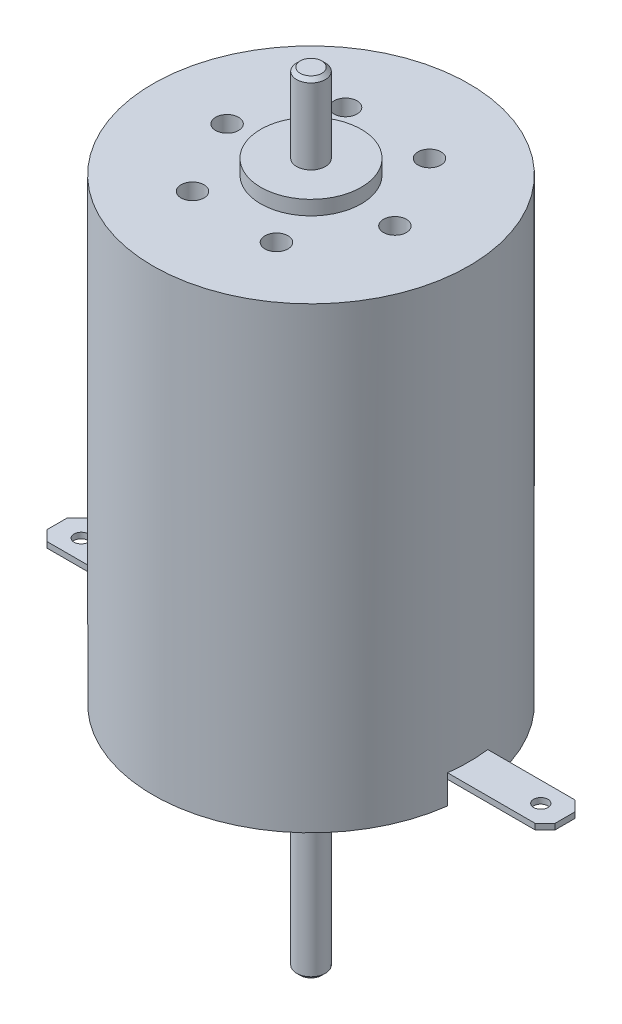
ISO-10303-21;
HEADER;
FILE_DESCRIPTION(('STEP AP214'),'2;1');
FILE_NAME('part.step','',(''),(''),'','','');
FILE_SCHEMA(('AUTOMOTIVE_DESIGN { 1 0 10303 214 1 1 1 1 }'));
ENDSEC;
DATA;
#1=APPLICATION_CONTEXT('core data for automotive mechanical design processes');
#2=APPLICATION_PROTOCOL_DEFINITION('international standard','automotive_design',2000,#1);
#3=PRODUCT_CONTEXT('',#1,'mechanical');
#4=PRODUCT('Part','Part','',(#3));
#5=PRODUCT_RELATED_PRODUCT_CATEGORY('part','',(#4));
#6=PRODUCT_DEFINITION_FORMATION('','',#4);
#7=PRODUCT_DEFINITION_CONTEXT('part definition',#1,'design');
#8=PRODUCT_DEFINITION('design','',#6,#7);
#9=PRODUCT_DEFINITION_SHAPE('','',#8);
#10=(LENGTH_UNIT() NAMED_UNIT(*) SI_UNIT(.MILLI.,.METRE.));
#11=(NAMED_UNIT(*) PLANE_ANGLE_UNIT() SI_UNIT($,.RADIAN.));
#12=(NAMED_UNIT(*) SI_UNIT($,.STERADIAN.) SOLID_ANGLE_UNIT());
#13=UNCERTAINTY_MEASURE_WITH_UNIT(LENGTH_MEASURE(1.E-05),#10,'distance_accuracy_value','');
#14=(GEOMETRIC_REPRESENTATION_CONTEXT(3) GLOBAL_UNCERTAINTY_ASSIGNED_CONTEXT((#13)) GLOBAL_UNIT_ASSIGNED_CONTEXT((#10,
#11,#12)) REPRESENTATION_CONTEXT('',''));
#15=CARTESIAN_POINT('',(0.,0.,0.));
#16=DIRECTION('',(0.,0.,1.));
#17=DIRECTION('',(1.,0.,0.));
#18=AXIS2_PLACEMENT_3D('',#15,#16,#17);
#19=CARTESIAN_POINT('',(-11.9169719169719,2.,1.4));
#20=DIRECTION('',(0.,0.,1.));
#21=DIRECTION('',(1.,0.,0.));
#22=AXIS2_PLACEMENT_3D('',#19,#20,#21);
#23=PLANE('',#22);
#24=DIRECTION('',(1.,0.,0.));
#25=VECTOR('',#24,1.);
#26=CARTESIAN_POINT('',(-17.7,1.6,1.4));
#27=LINE('',#26,#25);
#28=CARTESIAN_POINT('',(-10.9105453575887,1.6,1.4));
#29=VERTEX_POINT('',#28);
#30=CARTESIAN_POINT('',(-8.5,1.6,1.4));
#31=VERTEX_POINT('',#30);
#32=EDGE_CURVE('E191',#29,#31,#27,.T.);
#33=ORIENTED_EDGE('',*,*,#32,.T.);
#34=DIRECTION('',(0.,-1.,0.));
#35=VECTOR('',#34,1.);
#36=CARTESIAN_POINT('',(-8.5,2.,1.4));
#37=LINE('',#36,#35);
#38=CARTESIAN_POINT('',(-8.5,0.,1.4));
#39=VERTEX_POINT('',#38);
#40=EDGE_CURVE('E175',#31,#39,#37,.T.);
#41=ORIENTED_EDGE('',*,*,#40,.T.);
#42=DIRECTION('',(-1.,0.,0.));
#43=VECTOR('',#42,1.);
#44=CARTESIAN_POINT('',(-11.9169719169719,0.,1.4));
#45=LINE('',#44,#43);
#46=CARTESIAN_POINT('',(-10.9105453575887,0.,1.4));
#47=VERTEX_POINT('',#46);
#48=EDGE_CURVE('E262',#39,#47,#45,.T.);
#49=ORIENTED_EDGE('',*,*,#48,.T.);
#50=DIRECTION('',(0.,-1.,0.));
#51=VECTOR('',#50,1.);
#52=CARTESIAN_POINT('',(-10.9105453575887,31.9,1.4));
#53=LINE('',#52,#51);
#54=EDGE_CURVE('E192',#29,#47,#53,.T.);
#55=ORIENTED_EDGE('',*,*,#54,.F.);
#56=EDGE_LOOP('',(#33,#41,#49,#55));
#57=FACE_BOUND('',#56,.T.);
#58=ADVANCED_FACE('F33',(#57),#23,.F.);
#59=CARTESIAN_POINT('',(-11.9169719169719,2.,-1.4));
#60=DIRECTION('',(0.,0.,-1.));
#61=DIRECTION('',(-1.,0.,0.));
#62=AXIS2_PLACEMENT_3D('',#59,#60,#61);
#63=PLANE('',#62);
#64=DIRECTION('',(1.,0.,0.));
#65=VECTOR('',#64,1.);
#66=CARTESIAN_POINT('',(-17.7,1.6,-1.4));
#67=LINE('',#66,#65);
#68=CARTESIAN_POINT('',(-10.9105453575887,1.6,-1.4));
#69=VERTEX_POINT('',#68);
#70=CARTESIAN_POINT('',(-8.5,1.6,-1.4));
#71=VERTEX_POINT('',#70);
#72=EDGE_CURVE('E203',#69,#71,#67,.T.);
#73=ORIENTED_EDGE('',*,*,#72,.F.);
#74=DIRECTION('',(0.,-1.,0.));
#75=VECTOR('',#74,1.);
#76=CARTESIAN_POINT('',(-10.9105453575887,31.9,-1.4));
#77=LINE('',#76,#75);
#78=CARTESIAN_POINT('',(-10.9105453575887,0.,-1.4));
#79=VERTEX_POINT('',#78);
#80=EDGE_CURVE('E340',#79,#69,#77,.F.);
#81=ORIENTED_EDGE('',*,*,#80,.F.);
#82=DIRECTION('',(1.,0.,0.));
#83=VECTOR('',#82,1.);
#84=CARTESIAN_POINT('',(-11.9169719169719,0.,-1.4));
#85=LINE('',#84,#83);
#86=CARTESIAN_POINT('',(-8.5,0.,-1.4));
#87=VERTEX_POINT('',#86);
#88=EDGE_CURVE('E257',#79,#87,#85,.T.);
#89=ORIENTED_EDGE('',*,*,#88,.T.);
#90=DIRECTION('',(0.,-1.,0.));
#91=VECTOR('',#90,1.);
#92=CARTESIAN_POINT('',(-8.5,2.,-1.4));
#93=LINE('',#92,#91);
#94=EDGE_CURVE('E187',#71,#87,#93,.T.);
#95=ORIENTED_EDGE('',*,*,#94,.F.);
#96=EDGE_LOOP('',(#73,#81,#89,#95));
#97=FACE_BOUND('',#96,.T.);
#98=ADVANCED_FACE('F417',(#97),#63,.F.);
#99=CARTESIAN_POINT('',(-8.5,2.,1.4));
#100=DIRECTION('',(1.,0.,0.));
#101=DIRECTION('',(0.,0.,-1.));
#102=AXIS2_PLACEMENT_3D('',#99,#100,#101);
#103=PLANE('',#102);
#104=DIRECTION('',(0.,0.,1.));
#105=VECTOR('',#104,1.);
#106=CARTESIAN_POINT('',(-8.5,1.6,-1.4));
#107=LINE('',#106,#105);
#108=EDGE_CURVE('E179',#71,#31,#107,.T.);
#109=ORIENTED_EDGE('',*,*,#108,.F.);
#110=ORIENTED_EDGE('',*,*,#94,.T.);
#111=DIRECTION('',(0.,0.,1.));
#112=VECTOR('',#111,1.);
#113=CARTESIAN_POINT('',(-8.5,0.,1.4));
#114=LINE('',#113,#112);
#115=EDGE_CURVE('E182',#87,#39,#114,.T.);
#116=ORIENTED_EDGE('',*,*,#115,.T.);
#117=ORIENTED_EDGE('',*,*,#40,.F.);
#118=EDGE_LOOP('',(#109,#110,#116,#117));
#119=FACE_BOUND('',#118,.T.);
#120=ADVANCED_FACE('F177',(#119),#103,.F.);
#121=CARTESIAN_POINT('',(11.9169719169719,2.,-1.39999999999992));
#122=DIRECTION('',(0.,0.,-1.));
#123=DIRECTION('',(-1.,0.,0.));
#124=AXIS2_PLACEMENT_3D('',#121,#122,#123);
#125=PLANE('',#124);
#126=DIRECTION('',(-1.,0.,0.));
#127=VECTOR('',#126,1.);
#128=CARTESIAN_POINT('',(17.7,1.6,-1.39999999999987));
#129=LINE('',#128,#127);
#130=CARTESIAN_POINT('',(10.9105453575887,1.6,-1.39999999999992));
#131=VERTEX_POINT('',#130);
#132=CARTESIAN_POINT('',(8.50000000000001,1.6,-1.39999999999994));
#133=VERTEX_POINT('',#132);
#134=EDGE_CURVE('E236',#131,#133,#129,.T.);
#135=ORIENTED_EDGE('',*,*,#134,.T.);
#136=DIRECTION('',(0.,-1.,0.));
#137=VECTOR('',#136,1.);
#138=CARTESIAN_POINT('',(8.50000000000001,2.,-1.39999999999994));
#139=LINE('',#138,#137);
#140=CARTESIAN_POINT('',(8.50000000000001,0.,-1.39999999999994));
#141=VERTEX_POINT('',#140);
#142=EDGE_CURVE('E255',#133,#141,#139,.T.);
#143=ORIENTED_EDGE('',*,*,#142,.T.);
#144=DIRECTION('',(1.,0.,0.));
#145=VECTOR('',#144,1.);
#146=CARTESIAN_POINT('',(11.9169719169719,0.,-1.39999999999992));
#147=LINE('',#146,#145);
#148=CARTESIAN_POINT('',(10.9105453575887,0.,-1.39999999999992));
#149=VERTEX_POINT('',#148);
#150=EDGE_CURVE('E251',#141,#149,#147,.T.);
#151=ORIENTED_EDGE('',*,*,#150,.T.);
#152=DIRECTION('',(0.,-1.,0.));
#153=VECTOR('',#152,1.);
#154=CARTESIAN_POINT('',(10.9105453575887,31.9,-1.39999999999992));
#155=LINE('',#154,#153);
#156=EDGE_CURVE('E351',#131,#149,#155,.T.);
#157=ORIENTED_EDGE('',*,*,#156,.F.);
#158=EDGE_LOOP('',(#135,#143,#151,#157));
#159=FACE_BOUND('',#158,.T.);
#160=ADVANCED_FACE('F429',(#159),#125,.F.);
#161=CARTESIAN_POINT('',(11.9169719169719,2.,1.40000000000008));
#162=DIRECTION('',(0.,0.,1.));
#163=DIRECTION('',(1.,0.,0.));
#164=AXIS2_PLACEMENT_3D('',#161,#162,#163);
#165=PLANE('',#164);
#166=DIRECTION('',(-1.,0.,0.));
#167=VECTOR('',#166,1.);
#168=CARTESIAN_POINT('',(17.7,1.6,1.40000000000013));
#169=LINE('',#168,#167);
#170=CARTESIAN_POINT('',(10.9105453575887,1.6,1.40000000000008));
#171=VERTEX_POINT('',#170);
#172=CARTESIAN_POINT('',(8.49999999999999,1.6,1.40000000000006));
#173=VERTEX_POINT('',#172);
#174=EDGE_CURVE('E239',#171,#173,#169,.T.);
#175=ORIENTED_EDGE('',*,*,#174,.F.);
#176=DIRECTION('',(0.,-1.,0.));
#177=VECTOR('',#176,1.);
#178=CARTESIAN_POINT('',(10.9105453575887,31.9,1.40000000000008));
#179=LINE('',#178,#177);
#180=CARTESIAN_POINT('',(10.9105453575887,0.,1.40000000000008));
#181=VERTEX_POINT('',#180);
#182=EDGE_CURVE('E348',#181,#171,#179,.F.);
#183=ORIENTED_EDGE('',*,*,#182,.F.);
#184=DIRECTION('',(-1.,0.,0.));
#185=VECTOR('',#184,1.);
#186=CARTESIAN_POINT('',(11.9169719169719,0.,1.40000000000008));
#187=LINE('',#186,#185);
#188=CARTESIAN_POINT('',(8.49999999999999,0.,1.40000000000006));
#189=VERTEX_POINT('',#188);
#190=EDGE_CURVE('E245',#181,#189,#187,.T.);
#191=ORIENTED_EDGE('',*,*,#190,.T.);
#192=DIRECTION('',(0.,-1.,0.));
#193=VECTOR('',#192,1.);
#194=CARTESIAN_POINT('',(8.49999999999999,2.,1.40000000000006));
#195=LINE('',#194,#193);
#196=EDGE_CURVE('E254',#173,#189,#195,.T.);
#197=ORIENTED_EDGE('',*,*,#196,.F.);
#198=EDGE_LOOP('',(#175,#183,#191,#197));
#199=FACE_BOUND('',#198,.T.);
#200=ADVANCED_FACE('F426',(#199),#165,.F.);
#201=CARTESIAN_POINT('',(8.50000000000001,2.,-1.39999999999994));
#202=DIRECTION('',(-1.,0.,0.));
#203=DIRECTION('',(0.,0.,1.));
#204=AXIS2_PLACEMENT_3D('',#201,#202,#203);
#205=PLANE('',#204);
#206=DIRECTION('',(0.,0.,-1.));
#207=VECTOR('',#206,1.);
#208=CARTESIAN_POINT('',(8.49999999999999,1.6,1.40000000000006));
#209=LINE('',#208,#207);
#210=EDGE_CURVE('E223',#173,#133,#209,.T.);
#211=ORIENTED_EDGE('',*,*,#210,.F.);
#212=ORIENTED_EDGE('',*,*,#196,.T.);
#213=DIRECTION('',(0.,0.,-1.));
#214=VECTOR('',#213,1.);
#215=CARTESIAN_POINT('',(8.50000000000001,0.,-1.39999999999994));
#216=LINE('',#215,#214);
#217=EDGE_CURVE('E248',#189,#141,#216,.T.);
#218=ORIENTED_EDGE('',*,*,#217,.T.);
#219=ORIENTED_EDGE('',*,*,#142,.F.);
#220=EDGE_LOOP('',(#211,#212,#218,#219));
#221=FACE_BOUND('',#220,.T.);
#222=ADVANCED_FACE('F493',(#221),#205,.F.);
#223=CARTESIAN_POINT('',(0.,-2.5,0.));
#224=DIRECTION('',(0.,-1.,0.));
#225=DIRECTION('',(0.,0.,-1.));
#226=AXIS2_PLACEMENT_3D('',#223,#224,#225);
#227=PLANE('',#226);
#228=CARTESIAN_POINT('',(0.,-2.5,0.));
#229=DIRECTION('',(0.,-1.,0.));
#230=DIRECTION('',(0.,0.,-1.));
#231=AXIS2_PLACEMENT_3D('',#228,#229,#230);
#232=CIRCLE('',#231,4.);
#233=CARTESIAN_POINT('',(0.,-2.5,-4.));
#234=VERTEX_POINT('',#233);
#235=EDGE_CURVE('E303',#234,#234,#232,.T.);
#236=ORIENTED_EDGE('',*,*,#235,.T.);
#237=EDGE_LOOP('',(#236));
#238=FACE_BOUND('',#237,.T.);
#239=CARTESIAN_POINT('',(0.,-2.5,0.));
#240=DIRECTION('',(0.,-1.,0.));
#241=DIRECTION('',(0.,0.,-1.));
#242=AXIS2_PLACEMENT_3D('',#239,#240,#241);
#243=CIRCLE('',#242,1.);
#244=CARTESIAN_POINT('',(0.,-2.5,-1.));
#245=VERTEX_POINT('',#244);
#246=EDGE_CURVE('E300',#245,#245,#243,.T.);
#247=ORIENTED_EDGE('',*,*,#246,.F.);
#248=EDGE_LOOP('',(#247));
#249=FACE_BOUND('',#248,.T.);
#250=ADVANCED_FACE('F489',(#238,#249),#227,.T.);
#251=CARTESIAN_POINT('',(0.,0.,0.));
#252=DIRECTION('',(0.,1.,0.));
#253=DIRECTION('',(0.,0.,1.));
#254=AXIS2_PLACEMENT_3D('',#251,#252,#253);
#255=PLANE('',#254);
#256=CARTESIAN_POINT('',(0.,0.,0.));
#257=DIRECTION('',(0.,1.,0.));
#258=DIRECTION('',(0.,0.,1.));
#259=AXIS2_PLACEMENT_3D('',#256,#257,#258);
#260=CIRCLE('',#259,11.);
#261=EDGE_CURVE('E313',#149,#79,#260,.T.);
#262=ORIENTED_EDGE('',*,*,#261,.F.);
#263=ORIENTED_EDGE('',*,*,#150,.F.);
#264=ORIENTED_EDGE('',*,*,#217,.F.);
#265=ORIENTED_EDGE('',*,*,#190,.F.);
#266=EDGE_CURVE('E320',#47,#181,#260,.T.);
#267=ORIENTED_EDGE('',*,*,#266,.F.);
#268=ORIENTED_EDGE('',*,*,#48,.F.);
#269=ORIENTED_EDGE('',*,*,#115,.F.);
#270=ORIENTED_EDGE('',*,*,#88,.F.);
#271=EDGE_LOOP('',(#262,#263,#264,#265,#267,#268,#269,#270));
#272=FACE_BOUND('',#271,.T.);
#273=CARTESIAN_POINT('',(0.,0.,0.));
#274=DIRECTION('',(0.,1.,0.));
#275=DIRECTION('',(0.,0.,1.));
#276=AXIS2_PLACEMENT_3D('',#273,#274,#275);
#277=CIRCLE('',#276,4.);
#278=CARTESIAN_POINT('',(0.,0.,4.));
#279=VERTEX_POINT('',#278);
#280=EDGE_CURVE('E328',#279,#279,#277,.F.);
#281=ORIENTED_EDGE('',*,*,#280,.F.);
#282=EDGE_LOOP('',(#281));
#283=FACE_BOUND('',#282,.T.);
#284=ADVANCED_FACE('F492',(#272,#283),#255,.F.);
#285=CARTESIAN_POINT('',(0.,32.9,0.));
#286=DIRECTION('',(0.,1.,0.));
#287=DIRECTION('',(0.,0.,1.));
#288=AXIS2_PLACEMENT_3D('',#285,#286,#287);
#289=PLANE('',#288);
#290=CARTESIAN_POINT('',(0.,32.9,0.));
#291=DIRECTION('',(0.,1.,0.));
#292=DIRECTION('',(0.,0.,1.));
#293=AXIS2_PLACEMENT_3D('',#290,#291,#292);
#294=CIRCLE('',#293,3.5);
#295=CARTESIAN_POINT('',(0.,32.9,3.5));
#296=VERTEX_POINT('',#295);
#297=EDGE_CURVE('E310',#296,#296,#294,.T.);
#298=ORIENTED_EDGE('',*,*,#297,.T.);
#299=EDGE_LOOP('',(#298));
#300=FACE_BOUND('',#299,.T.);
#301=CARTESIAN_POINT('',(0.,32.9,0.));
#302=DIRECTION('',(0.,1.,0.));
#303=DIRECTION('',(0.,0.,1.));
#304=AXIS2_PLACEMENT_3D('',#301,#302,#303);
#305=CIRCLE('',#304,1.);
#306=CARTESIAN_POINT('',(0.,32.9,1.));
#307=VERTEX_POINT('',#306);
#308=EDGE_CURVE('E306',#307,#307,#305,.T.);
#309=ORIENTED_EDGE('',*,*,#308,.F.);
#310=EDGE_LOOP('',(#309));
#311=FACE_BOUND('',#310,.T.);
#312=ADVANCED_FACE('F508',(#300,#311),#289,.T.);
#313=CARTESIAN_POINT('',(0.,31.9,0.));
#314=DIRECTION('',(0.,1.,0.));
#315=DIRECTION('',(0.,0.,1.));
#316=AXIS2_PLACEMENT_3D('',#313,#314,#315);
#317=PLANE('',#316);
#318=CARTESIAN_POINT('',(-5.99801144222011,31.9,-0.15446274306963));
#319=DIRECTION('',(0.,1.,0.));
#320=DIRECTION('',(0.,0.,1.));
#321=AXIS2_PLACEMENT_3D('',#318,#319,#320);
#322=CIRCLE('',#321,0.79999999999999);
#323=CARTESIAN_POINT('',(-5.99801144222011,31.9,0.64553725693036));
#324=VERTEX_POINT('',#323);
#325=EDGE_CURVE('E267',#324,#324,#322,.T.);
#326=ORIENTED_EDGE('',*,*,#325,.F.);
#327=EDGE_LOOP('',(#326));
#328=FACE_BOUND('',#327,.T.);
#329=CARTESIAN_POINT('',(-3.13277438054657,31.9,5.11719890961755));
#330=DIRECTION('',(0.,1.,0.));
#331=DIRECTION('',(0.,0.,1.));
#332=AXIS2_PLACEMENT_3D('',#329,#330,#331);
#333=CIRCLE('',#332,0.79999999999999);
#334=CARTESIAN_POINT('',(-3.13277438054657,31.9,5.91719890961754));
#335=VERTEX_POINT('',#334);
#336=EDGE_CURVE('E273',#335,#335,#333,.T.);
#337=ORIENTED_EDGE('',*,*,#336,.F.);
#338=EDGE_LOOP('',(#337));
#339=FACE_BOUND('',#338,.T.);
#340=CARTESIAN_POINT('',(2.86523706167355,31.9,5.27166165268716));
#341=DIRECTION('',(0.,1.,0.));
#342=DIRECTION('',(0.,0.,1.));
#343=AXIS2_PLACEMENT_3D('',#340,#341,#342);
#344=CIRCLE('',#343,0.79999999999999);
#345=CARTESIAN_POINT('',(2.86523706167355,31.9,6.07166165268715));
#346=VERTEX_POINT('',#345);
#347=EDGE_CURVE('E279',#346,#346,#344,.T.);
#348=ORIENTED_EDGE('',*,*,#347,.F.);
#349=EDGE_LOOP('',(#348));
#350=FACE_BOUND('',#349,.T.);
#351=CARTESIAN_POINT('',(5.99801144222012,31.9,0.154462743069588));
#352=DIRECTION('',(0.,1.,0.));
#353=DIRECTION('',(0.,0.,1.));
#354=AXIS2_PLACEMENT_3D('',#351,#352,#353);
#355=CIRCLE('',#354,0.79999999999999);
#356=CARTESIAN_POINT('',(5.99801144222012,31.9,0.954462743069578));
#357=VERTEX_POINT('',#356);
#358=EDGE_CURVE('E285',#357,#357,#355,.T.);
#359=ORIENTED_EDGE('',*,*,#358,.F.);
#360=EDGE_LOOP('',(#359));
#361=FACE_BOUND('',#360,.T.);
#362=CARTESIAN_POINT('',(3.13277438054654,31.9,-5.11719890961757));
#363=DIRECTION('',(0.,1.,0.));
#364=DIRECTION('',(0.,0.,1.));
#365=AXIS2_PLACEMENT_3D('',#362,#363,#364);
#366=CIRCLE('',#365,0.79999999999999);
#367=CARTESIAN_POINT('',(3.13277438054654,31.9,-4.31719890961758));
#368=VERTEX_POINT('',#367);
#369=EDGE_CURVE('E291',#368,#368,#366,.T.);
#370=ORIENTED_EDGE('',*,*,#369,.F.);
#371=EDGE_LOOP('',(#370));
#372=FACE_BOUND('',#371,.T.);
#373=CARTESIAN_POINT('',(-2.86523706167359,31.9,-5.27166165268714));
#374=DIRECTION('',(0.,1.,0.));
#375=DIRECTION('',(0.,0.,1.));
#376=AXIS2_PLACEMENT_3D('',#373,#374,#375);
#377=CIRCLE('',#376,0.79999999999999);
#378=CARTESIAN_POINT('',(-2.86523706167359,31.9,-4.47166165268715));
#379=VERTEX_POINT('',#378);
#380=EDGE_CURVE('E297',#379,#379,#377,.T.);
#381=ORIENTED_EDGE('',*,*,#380,.F.);
#382=EDGE_LOOP('',(#381));
#383=FACE_BOUND('',#382,.T.);
#384=CARTESIAN_POINT('',(0.,31.9,0.));
#385=DIRECTION('',(0.,1.,0.));
#386=DIRECTION('',(0.,0.,1.));
#387=AXIS2_PLACEMENT_3D('',#384,#385,#386);
#388=CIRCLE('',#387,11.);
#389=CARTESIAN_POINT('',(0.,31.9,11.));
#390=VERTEX_POINT('',#389);
#391=EDGE_CURVE('E316',#390,#390,#388,.T.);
#392=ORIENTED_EDGE('',*,*,#391,.T.);
#393=EDGE_LOOP('',(#392));
#394=FACE_BOUND('',#393,.T.);
#395=CARTESIAN_POINT('',(0.,31.9,0.));
#396=DIRECTION('',(0.,1.,0.));
#397=DIRECTION('',(0.,0.,1.));
#398=AXIS2_PLACEMENT_3D('',#395,#396,#397);
#399=CIRCLE('',#398,3.5);
#400=CARTESIAN_POINT('',(0.,31.9,3.5));
#401=VERTEX_POINT('',#400);
#402=EDGE_CURVE('E309',#401,#401,#399,.T.);
#403=ORIENTED_EDGE('',*,*,#402,.F.);
#404=EDGE_LOOP('',(#403));
#405=FACE_BOUND('',#404,.T.);
#406=ADVANCED_FACE('F511',(#328,#339,#350,#361,#372,#383,#394,#405),#317,.T.);
#407=CARTESIAN_POINT('',(0.,31.9,0.));
#408=DIRECTION('',(0.,-1.,0.));
#409=DIRECTION('',(0.,0.,-1.));
#410=AXIS2_PLACEMENT_3D('',#407,#408,#409);
#411=CYLINDRICAL_SURFACE('',#410,11.);
#412=ORIENTED_EDGE('',*,*,#391,.F.);
#413=EDGE_LOOP('',(#412));
#414=FACE_BOUND('',#413,.T.);
#415=CARTESIAN_POINT('',(0.,2.,0.));
#416=DIRECTION('',(0.,-1.,0.));
#417=DIRECTION('',(0.,0.,-1.));
#418=AXIS2_PLACEMENT_3D('',#415,#416,#417);
#419=CIRCLE('',#418,11.);
#420=CARTESIAN_POINT('',(10.9105453575887,2.,-1.39999999999992));
#421=VERTEX_POINT('',#420);
#422=CARTESIAN_POINT('',(10.9105453575887,2.,1.40000000000008));
#423=VERTEX_POINT('',#422);
#424=EDGE_CURVE('E345',#421,#423,#419,.T.);
#425=ORIENTED_EDGE('',*,*,#424,.F.);
#426=EDGE_CURVE('E352',#421,#131,#155,.T.);
#427=ORIENTED_EDGE('',*,*,#426,.T.);
#428=ORIENTED_EDGE('',*,*,#156,.T.);
#429=ORIENTED_EDGE('',*,*,#261,.T.);
#430=ORIENTED_EDGE('',*,*,#80,.T.);
#431=DIRECTION('',(0.,-1.,0.));
#432=VECTOR('',#431,1.);
#433=CARTESIAN_POINT('',(-10.9105453575887,31.9,-1.4));
#434=LINE('',#433,#432);
#435=CARTESIAN_POINT('',(-10.9105453575887,2.,-1.4));
#436=VERTEX_POINT('',#435);
#437=EDGE_CURVE('E220',#436,#69,#434,.T.);
#438=ORIENTED_EDGE('',*,*,#437,.F.);
#439=CARTESIAN_POINT('',(0.,2.,0.));
#440=DIRECTION('',(0.,-1.,0.));
#441=DIRECTION('',(0.,0.,-1.));
#442=AXIS2_PLACEMENT_3D('',#439,#440,#441);
#443=CIRCLE('',#442,11.);
#444=CARTESIAN_POINT('',(-10.9105453575887,2.,1.4));
#445=VERTEX_POINT('',#444);
#446=EDGE_CURVE('E337',#445,#436,#443,.T.);
#447=ORIENTED_EDGE('',*,*,#446,.F.);
#448=EDGE_CURVE('E343',#445,#29,#53,.T.);
#449=ORIENTED_EDGE('',*,*,#448,.T.);
#450=ORIENTED_EDGE('',*,*,#54,.T.);
#451=ORIENTED_EDGE('',*,*,#266,.T.);
#452=ORIENTED_EDGE('',*,*,#182,.T.);
#453=DIRECTION('',(0.,-1.,0.));
#454=VECTOR('',#453,1.);
#455=CARTESIAN_POINT('',(10.9105453575887,31.9,1.40000000000008));
#456=LINE('',#455,#454);
#457=EDGE_CURVE('E242',#423,#171,#456,.T.);
#458=ORIENTED_EDGE('',*,*,#457,.F.);
#459=EDGE_LOOP('',(#425,#427,#428,#429,#430,#438,#447,#449,#450,#451,#452,#458));
#460=FACE_BOUND('',#459,.T.);
#461=ADVANCED_FACE('F398',(#414,#460),#411,.T.);
#462=CARTESIAN_POINT('',(0.,32.9,0.));
#463=DIRECTION('',(0.,-1.,0.));
#464=DIRECTION('',(0.,0.,-1.));
#465=AXIS2_PLACEMENT_3D('',#462,#463,#464);
#466=CYLINDRICAL_SURFACE('',#465,3.5);
#467=ORIENTED_EDGE('',*,*,#297,.F.);
#468=EDGE_LOOP('',(#467));
#469=FACE_BOUND('',#468,.T.);
#470=ORIENTED_EDGE('',*,*,#402,.T.);
#471=EDGE_LOOP('',(#470));
#472=FACE_BOUND('',#471,.T.);
#473=ADVANCED_FACE('F506',(#469,#472),#466,.T.);
#474=CARTESIAN_POINT('',(0.,38.4,0.));
#475=DIRECTION('',(0.,-1.,0.));
#476=DIRECTION('',(0.,0.,-1.));
#477=AXIS2_PLACEMENT_3D('',#474,#475,#476);
#478=CYLINDRICAL_SURFACE('',#477,1.);
#479=CARTESIAN_POINT('',(0.,38.15,0.));
#480=DIRECTION('',(0.,1.,0.));
#481=DIRECTION('',(0.,0.,1.));
#482=AXIS2_PLACEMENT_3D('',#479,#480,#481);
#483=CIRCLE('',#482,1.);
#484=CARTESIAN_POINT('',(0.,38.15,1.));
#485=VERTEX_POINT('',#484);
#486=EDGE_CURVE('E325',#485,#485,#483,.F.);
#487=ORIENTED_EDGE('',*,*,#486,.T.);
#488=EDGE_LOOP('',(#487));
#489=FACE_BOUND('',#488,.T.);
#490=ORIENTED_EDGE('',*,*,#308,.T.);
#491=EDGE_LOOP('',(#490));
#492=FACE_BOUND('',#491,.T.);
#493=ADVANCED_FACE('F502',(#489,#492),#478,.T.);
#494=CARTESIAN_POINT('',(0.,38.4,0.));
#495=DIRECTION('',(0.,1.,0.));
#496=DIRECTION('',(0.,0.,1.));
#497=AXIS2_PLACEMENT_3D('',#494,#495,#496);
#498=PLANE('',#497);
#499=CARTESIAN_POINT('',(0.,38.4,0.));
#500=DIRECTION('',(0.,1.,0.));
#501=DIRECTION('',(0.,0.,1.));
#502=AXIS2_PLACEMENT_3D('',#499,#500,#501);
#503=CIRCLE('',#502,0.750000000000001);
#504=CARTESIAN_POINT('',(0.,38.4,0.750000000000001));
#505=VERTEX_POINT('',#504);
#506=EDGE_CURVE('E319',#505,#505,#503,.T.);
#507=ORIENTED_EDGE('',*,*,#506,.T.);
#508=EDGE_LOOP('',(#507));
#509=FACE_BOUND('',#508,.T.);
#510=ADVANCED_FACE('F499',(#509),#498,.T.);
#511=CARTESIAN_POINT('',(0.,38.4,0.));
#512=DIRECTION('',(0.,-1.,0.));
#513=DIRECTION('',(0.,0.,-1.));
#514=AXIS2_PLACEMENT_3D('',#511,#512,#513);
#515=CONICAL_SURFACE('',#514,0.750000000000001,0.78539816339746);
#516=ORIENTED_EDGE('',*,*,#486,.F.);
#517=EDGE_LOOP('',(#516));
#518=FACE_BOUND('',#517,.T.);
#519=ORIENTED_EDGE('',*,*,#506,.F.);
#520=EDGE_LOOP('',(#519));
#521=FACE_BOUND('',#520,.T.);
#522=ADVANCED_FACE('F497',(#518,#521),#515,.T.);
#523=CARTESIAN_POINT('',(0.,-2.5,0.));
#524=DIRECTION('',(0.,1.,0.));
#525=DIRECTION('',(0.,0.,1.));
#526=AXIS2_PLACEMENT_3D('',#523,#524,#525);
#527=CYLINDRICAL_SURFACE('',#526,4.);
#528=ORIENTED_EDGE('',*,*,#235,.F.);
#529=EDGE_LOOP('',(#528));
#530=FACE_BOUND('',#529,.T.);
#531=ORIENTED_EDGE('',*,*,#280,.T.);
#532=EDGE_LOOP('',(#531));
#533=FACE_BOUND('',#532,.T.);
#534=ADVANCED_FACE('F487',(#530,#533),#527,.T.);
#535=CARTESIAN_POINT('',(0.,-16.,0.));
#536=DIRECTION('',(0.,1.,0.));
#537=DIRECTION('',(0.,0.,1.));
#538=AXIS2_PLACEMENT_3D('',#535,#536,#537);
#539=CYLINDRICAL_SURFACE('',#538,1.);
#540=CARTESIAN_POINT('',(0.,-15.75,0.));
#541=DIRECTION('',(0.,-1.,0.));
#542=DIRECTION('',(0.,0.,-1.));
#543=AXIS2_PLACEMENT_3D('',#540,#541,#542);
#544=CIRCLE('',#543,1.);
#545=CARTESIAN_POINT('',(0.,-15.75,-1.));
#546=VERTEX_POINT('',#545);
#547=EDGE_CURVE('E334',#546,#546,#544,.F.);
#548=ORIENTED_EDGE('',*,*,#547,.T.);
#549=EDGE_LOOP('',(#548));
#550=FACE_BOUND('',#549,.T.);
#551=ORIENTED_EDGE('',*,*,#246,.T.);
#552=EDGE_LOOP('',(#551));
#553=FACE_BOUND('',#552,.T.);
#554=ADVANCED_FACE('F483',(#550,#553),#539,.T.);
#555=CARTESIAN_POINT('',(0.,-16.,0.));
#556=DIRECTION('',(0.,-1.,0.));
#557=DIRECTION('',(0.,0.,-1.));
#558=AXIS2_PLACEMENT_3D('',#555,#556,#557);
#559=PLANE('',#558);
#560=CARTESIAN_POINT('',(0.,-16.,0.));
#561=DIRECTION('',(0.,-1.,0.));
#562=DIRECTION('',(0.,0.,-1.));
#563=AXIS2_PLACEMENT_3D('',#560,#561,#562);
#564=CIRCLE('',#563,0.750000000000001);
#565=CARTESIAN_POINT('',(0.,-16.,-0.750000000000001));
#566=VERTEX_POINT('',#565);
#567=EDGE_CURVE('E331',#566,#566,#564,.T.);
#568=ORIENTED_EDGE('',*,*,#567,.T.);
#569=EDGE_LOOP('',(#568));
#570=FACE_BOUND('',#569,.T.);
#571=ADVANCED_FACE('F479',(#570),#559,.T.);
#572=CARTESIAN_POINT('',(-2.86523706167359,31.9,-5.27166165268714));
#573=DIRECTION('',(0.,1.,0.));
#574=DIRECTION('',(0.,0.,1.));
#575=AXIS2_PLACEMENT_3D('',#572,#573,#574);
#576=CYLINDRICAL_SURFACE('',#575,0.799999999999994);
#577=CARTESIAN_POINT('',(-2.86523706167359,27.9,-5.27166165268714));
#578=DIRECTION('',(0.,1.,0.));
#579=DIRECTION('',(0.,0.,1.));
#580=AXIS2_PLACEMENT_3D('',#577,#578,#579);
#581=CIRCLE('',#580,0.799999999999999);
#582=CARTESIAN_POINT('',(-2.86523706167359,27.9,-4.47166165268714));
#583=VERTEX_POINT('',#582);
#584=EDGE_CURVE('E294',#583,#583,#581,.T.);
#585=ORIENTED_EDGE('',*,*,#584,.F.);
#586=EDGE_LOOP('',(#585));
#587=FACE_BOUND('',#586,.T.);
#588=ORIENTED_EDGE('',*,*,#380,.T.);
#589=EDGE_LOOP('',(#588));
#590=FACE_BOUND('',#589,.T.);
#591=ADVANCED_FACE('F475',(#587,#590),#576,.F.);
#592=CARTESIAN_POINT('',(-2.86523706167359,27.9,-5.27166165268714));
#593=DIRECTION('',(0.,1.,0.));
#594=DIRECTION('',(0.,0.,1.));
#595=AXIS2_PLACEMENT_3D('',#592,#593,#594);
#596=CONICAL_SURFACE('',#595,0.799999999999999,1.02974425867665);
#597=CARTESIAN_POINT('',(-2.86523706167359,27.419311504778,-5.27166165268714));
#598=VERTEX_POINT('',#597);
#599=VERTEX_LOOP('',#598);
#600=FACE_BOUND('',#599,.T.);
#601=ORIENTED_EDGE('',*,*,#584,.T.);
#602=EDGE_LOOP('',(#601));
#603=FACE_BOUND('',#602,.T.);
#604=ADVANCED_FACE('F471',(#600,#603),#596,.F.);
#605=CARTESIAN_POINT('',(3.13277438054654,31.9,-5.11719890961757));
#606=DIRECTION('',(0.,1.,0.));
#607=DIRECTION('',(0.,0.,1.));
#608=AXIS2_PLACEMENT_3D('',#605,#606,#607);
#609=CYLINDRICAL_SURFACE('',#608,0.799999999999994);
#610=CARTESIAN_POINT('',(3.13277438054654,27.9,-5.11719890961757));
#611=DIRECTION('',(0.,1.,0.));
#612=DIRECTION('',(0.,0.,1.));
#613=AXIS2_PLACEMENT_3D('',#610,#611,#612);
#614=CIRCLE('',#613,0.799999999999999);
#615=CARTESIAN_POINT('',(3.13277438054654,27.9,-4.31719890961757));
#616=VERTEX_POINT('',#615);
#617=EDGE_CURVE('E288',#616,#616,#614,.T.);
#618=ORIENTED_EDGE('',*,*,#617,.F.);
#619=EDGE_LOOP('',(#618));
#620=FACE_BOUND('',#619,.T.);
#621=ORIENTED_EDGE('',*,*,#369,.T.);
#622=EDGE_LOOP('',(#621));
#623=FACE_BOUND('',#622,.T.);
#624=ADVANCED_FACE('F467',(#620,#623),#609,.F.);
#625=CARTESIAN_POINT('',(3.13277438054654,27.9,-5.11719890961757));
#626=DIRECTION('',(0.,1.,0.));
#627=DIRECTION('',(0.,0.,1.));
#628=AXIS2_PLACEMENT_3D('',#625,#626,#627);
#629=CONICAL_SURFACE('',#628,0.799999999999999,1.02974425867665);
#630=CARTESIAN_POINT('',(3.13277438054654,27.419311504778,-5.11719890961757));
#631=VERTEX_POINT('',#630);
#632=VERTEX_LOOP('',#631);
#633=FACE_BOUND('',#632,.T.);
#634=ORIENTED_EDGE('',*,*,#617,.T.);
#635=EDGE_LOOP('',(#634));
#636=FACE_BOUND('',#635,.T.);
#637=ADVANCED_FACE('F463',(#633,#636),#629,.F.);
#638=CARTESIAN_POINT('',(5.99801144222012,31.9,0.154462743069588));
#639=DIRECTION('',(0.,1.,0.));
#640=DIRECTION('',(0.,0.,1.));
#641=AXIS2_PLACEMENT_3D('',#638,#639,#640);
#642=CYLINDRICAL_SURFACE('',#641,0.799999999999994);
#643=CARTESIAN_POINT('',(5.99801144222012,27.9,0.154462743069588));
#644=DIRECTION('',(0.,1.,0.));
#645=DIRECTION('',(0.,0.,1.));
#646=AXIS2_PLACEMENT_3D('',#643,#644,#645);
#647=CIRCLE('',#646,0.799999999999999);
#648=CARTESIAN_POINT('',(5.99801144222012,27.9,0.954462743069586));
#649=VERTEX_POINT('',#648);
#650=EDGE_CURVE('E282',#649,#649,#647,.T.);
#651=ORIENTED_EDGE('',*,*,#650,.F.);
#652=EDGE_LOOP('',(#651));
#653=FACE_BOUND('',#652,.T.);
#654=ORIENTED_EDGE('',*,*,#358,.T.);
#655=EDGE_LOOP('',(#654));
#656=FACE_BOUND('',#655,.T.);
#657=ADVANCED_FACE('F459',(#653,#656),#642,.F.);
#658=CARTESIAN_POINT('',(5.99801144222012,27.9,0.154462743069588));
#659=DIRECTION('',(0.,1.,0.));
#660=DIRECTION('',(0.,0.,1.));
#661=AXIS2_PLACEMENT_3D('',#658,#659,#660);
#662=CONICAL_SURFACE('',#661,0.799999999999999,1.02974425867665);
#663=CARTESIAN_POINT('',(5.99801144222011,27.419311504778,0.154462743069588));
#664=VERTEX_POINT('',#663);
#665=VERTEX_LOOP('',#664);
#666=FACE_BOUND('',#665,.T.);
#667=ORIENTED_EDGE('',*,*,#650,.T.);
#668=EDGE_LOOP('',(#667));
#669=FACE_BOUND('',#668,.T.);
#670=ADVANCED_FACE('F455',(#666,#669),#662,.F.);
#671=CARTESIAN_POINT('',(2.86523706167355,31.9,5.27166165268716));
#672=DIRECTION('',(0.,1.,0.));
#673=DIRECTION('',(0.,0.,1.));
#674=AXIS2_PLACEMENT_3D('',#671,#672,#673);
#675=CYLINDRICAL_SURFACE('',#674,0.799999999999994);
#676=CARTESIAN_POINT('',(2.86523706167355,27.9,5.27166165268716));
#677=DIRECTION('',(0.,1.,0.));
#678=DIRECTION('',(0.,0.,1.));
#679=AXIS2_PLACEMENT_3D('',#676,#677,#678);
#680=CIRCLE('',#679,0.799999999999999);
#681=CARTESIAN_POINT('',(2.86523706167355,27.9,6.07166165268716));
#682=VERTEX_POINT('',#681);
#683=EDGE_CURVE('E276',#682,#682,#680,.T.);
#684=ORIENTED_EDGE('',*,*,#683,.F.);
#685=EDGE_LOOP('',(#684));
#686=FACE_BOUND('',#685,.T.);
#687=ORIENTED_EDGE('',*,*,#347,.T.);
#688=EDGE_LOOP('',(#687));
#689=FACE_BOUND('',#688,.T.);
#690=ADVANCED_FACE('F451',(#686,#689),#675,.F.);
#691=CARTESIAN_POINT('',(2.86523706167355,27.9,5.27166165268716));
#692=DIRECTION('',(0.,1.,0.));
#693=DIRECTION('',(0.,0.,1.));
#694=AXIS2_PLACEMENT_3D('',#691,#692,#693);
#695=CONICAL_SURFACE('',#694,0.799999999999999,1.02974425867665);
#696=CARTESIAN_POINT('',(2.86523706167355,27.419311504778,5.27166165268716));
#697=VERTEX_POINT('',#696);
#698=VERTEX_LOOP('',#697);
#699=FACE_BOUND('',#698,.T.);
#700=ORIENTED_EDGE('',*,*,#683,.T.);
#701=EDGE_LOOP('',(#700));
#702=FACE_BOUND('',#701,.T.);
#703=ADVANCED_FACE('F447',(#699,#702),#695,.F.);
#704=CARTESIAN_POINT('',(-3.13277438054657,31.9,5.11719890961755));
#705=DIRECTION('',(0.,1.,0.));
#706=DIRECTION('',(0.,0.,1.));
#707=AXIS2_PLACEMENT_3D('',#704,#705,#706);
#708=CYLINDRICAL_SURFACE('',#707,0.799999999999994);
#709=CARTESIAN_POINT('',(-3.13277438054657,27.9,5.11719890961755));
#710=DIRECTION('',(0.,1.,0.));
#711=DIRECTION('',(0.,0.,1.));
#712=AXIS2_PLACEMENT_3D('',#709,#710,#711);
#713=CIRCLE('',#712,0.799999999999999);
#714=CARTESIAN_POINT('',(-3.13277438054657,27.9,5.91719890961755));
#715=VERTEX_POINT('',#714);
#716=EDGE_CURVE('E270',#715,#715,#713,.T.);
#717=ORIENTED_EDGE('',*,*,#716,.F.);
#718=EDGE_LOOP('',(#717));
#719=FACE_BOUND('',#718,.T.);
#720=ORIENTED_EDGE('',*,*,#336,.T.);
#721=EDGE_LOOP('',(#720));
#722=FACE_BOUND('',#721,.T.);
#723=ADVANCED_FACE('F443',(#719,#722),#708,.F.);
#724=CARTESIAN_POINT('',(-3.13277438054657,27.9,5.11719890961755));
#725=DIRECTION('',(0.,1.,0.));
#726=DIRECTION('',(0.,0.,1.));
#727=AXIS2_PLACEMENT_3D('',#724,#725,#726);
#728=CONICAL_SURFACE('',#727,0.799999999999999,1.02974425867665);
#729=CARTESIAN_POINT('',(-3.13277438054657,27.419311504778,5.11719890961755));
#730=VERTEX_POINT('',#729);
#731=VERTEX_LOOP('',#730);
#732=FACE_BOUND('',#731,.T.);
#733=ORIENTED_EDGE('',*,*,#716,.T.);
#734=EDGE_LOOP('',(#733));
#735=FACE_BOUND('',#734,.T.);
#736=ADVANCED_FACE('F439',(#732,#735),#728,.F.);
#737=CARTESIAN_POINT('',(-5.99801144222011,31.9,-0.15446274306963));
#738=DIRECTION('',(0.,1.,0.));
#739=DIRECTION('',(0.,0.,1.));
#740=AXIS2_PLACEMENT_3D('',#737,#738,#739);
#741=CYLINDRICAL_SURFACE('',#740,0.799999999999994);
#742=CARTESIAN_POINT('',(-5.99801144222011,27.9,-0.15446274306963));
#743=DIRECTION('',(0.,1.,0.));
#744=DIRECTION('',(0.,0.,1.));
#745=AXIS2_PLACEMENT_3D('',#742,#743,#744);
#746=CIRCLE('',#745,0.799999999999999);
#747=CARTESIAN_POINT('',(-5.99801144222011,27.9,0.645537256930369));
#748=VERTEX_POINT('',#747);
#749=EDGE_CURVE('E186',#748,#748,#746,.T.);
#750=ORIENTED_EDGE('',*,*,#749,.F.);
#751=EDGE_LOOP('',(#750));
#752=FACE_BOUND('',#751,.T.);
#753=ORIENTED_EDGE('',*,*,#325,.T.);
#754=EDGE_LOOP('',(#753));
#755=FACE_BOUND('',#754,.T.);
#756=ADVANCED_FACE('F435',(#752,#755),#741,.F.);
#757=CARTESIAN_POINT('',(-5.99801144222011,27.9,-0.15446274306963));
#758=DIRECTION('',(0.,1.,0.));
#759=DIRECTION('',(0.,0.,1.));
#760=AXIS2_PLACEMENT_3D('',#757,#758,#759);
#761=CONICAL_SURFACE('',#760,0.799999999999999,1.02974425867665);
#762=CARTESIAN_POINT('',(-5.99801144222011,27.419311504778,-0.15446274306963));
#763=VERTEX_POINT('',#762);
#764=VERTEX_LOOP('',#763);
#765=FACE_BOUND('',#764,.T.);
#766=ORIENTED_EDGE('',*,*,#749,.T.);
#767=EDGE_LOOP('',(#766));
#768=FACE_BOUND('',#767,.T.);
#769=ADVANCED_FACE('F431',(#765,#768),#761,.F.);
#770=CARTESIAN_POINT('',(0.,-16.,0.));
#771=DIRECTION('',(0.,1.,0.));
#772=DIRECTION('',(0.,0.,1.));
#773=AXIS2_PLACEMENT_3D('',#770,#771,#772);
#774=CONICAL_SURFACE('',#773,0.750000000000001,0.785398163397453);
#775=ORIENTED_EDGE('',*,*,#547,.F.);
#776=EDGE_LOOP('',(#775));
#777=FACE_BOUND('',#776,.T.);
#778=ORIENTED_EDGE('',*,*,#567,.F.);
#779=EDGE_LOOP('',(#778));
#780=FACE_BOUND('',#779,.T.);
#781=ADVANCED_FACE('F434',(#777,#780),#774,.T.);
#782=CARTESIAN_POINT('',(17.7,2.,1.40000000000013));
#783=DIRECTION('',(0.,0.,-1.));
#784=DIRECTION('',(-1.,0.,0.));
#785=AXIS2_PLACEMENT_3D('',#782,#783,#784);
#786=PLANE('',#785);
#787=CARTESIAN_POINT('',(17.,1.6,1.40000000000012));
#788=VERTEX_POINT('',#787);
#789=EDGE_CURVE('E240',#788,#171,#169,.T.);
#790=ORIENTED_EDGE('',*,*,#789,.F.);
#791=DIRECTION('',(0.,1.,0.));
#792=VECTOR('',#791,1.);
#793=CARTESIAN_POINT('',(17.,2.,1.40000000000012));
#794=LINE('',#793,#792);
#795=CARTESIAN_POINT('',(17.,2.,1.40000000000012));
#796=VERTEX_POINT('',#795);
#797=EDGE_CURVE('E371',#788,#796,#794,.T.);
#798=ORIENTED_EDGE('',*,*,#797,.T.);
#799=DIRECTION('',(-1.,0.,0.));
#800=VECTOR('',#799,1.);
#801=CARTESIAN_POINT('',(17.7,2.,1.40000000000013));
#802=LINE('',#801,#800);
#803=EDGE_CURVE('E230',#796,#423,#802,.T.);
#804=ORIENTED_EDGE('',*,*,#803,.T.);
#805=ORIENTED_EDGE('',*,*,#457,.T.);
#806=EDGE_LOOP('',(#790,#798,#804,#805));
#807=FACE_BOUND('',#806,.T.);
#808=ADVANCED_FACE('F530',(#807),#786,.F.);
#809=CARTESIAN_POINT('',(17.7,2.,-1.39999999999987));
#810=DIRECTION('',(0.,0.,1.));
#811=DIRECTION('',(1.,0.,0.));
#812=AXIS2_PLACEMENT_3D('',#809,#810,#811);
#813=PLANE('',#812);
#814=DIRECTION('',(-1.,0.,0.));
#815=VECTOR('',#814,1.);
#816=CARTESIAN_POINT('',(17.7,2.,-1.39999999999987));
#817=LINE('',#816,#815);
#818=CARTESIAN_POINT('',(17.,2.,-1.39999999999988));
#819=VERTEX_POINT('',#818);
#820=EDGE_CURVE('E234',#819,#421,#817,.T.);
#821=ORIENTED_EDGE('',*,*,#820,.F.);
#822=DIRECTION('',(0.,-1.,0.));
#823=VECTOR('',#822,1.);
#824=CARTESIAN_POINT('',(17.,1.6,-1.39999999999988));
#825=LINE('',#824,#823);
#826=CARTESIAN_POINT('',(17.,1.6,-1.39999999999988));
#827=VERTEX_POINT('',#826);
#828=EDGE_CURVE('E365',#819,#827,#825,.T.);
#829=ORIENTED_EDGE('',*,*,#828,.T.);
#830=EDGE_CURVE('E237',#827,#131,#129,.T.);
#831=ORIENTED_EDGE('',*,*,#830,.T.);
#832=ORIENTED_EDGE('',*,*,#426,.F.);
#833=EDGE_LOOP('',(#821,#829,#831,#832));
#834=FACE_BOUND('',#833,.T.);
#835=ADVANCED_FACE('F556',(#834),#813,.F.);
#836=CARTESIAN_POINT('',(17.7,2.,1.40000000000013));
#837=DIRECTION('',(0.,-1.,0.));
#838=DIRECTION('',(0.,0.,-1.));
#839=AXIS2_PLACEMENT_3D('',#836,#837,#838);
#840=PLANE('',#839);
#841=CARTESIAN_POINT('',(16.,2.,0.));
#842=DIRECTION('',(0.,-1.,0.));
#843=DIRECTION('',(0.,0.,-1.));
#844=AXIS2_PLACEMENT_3D('',#841,#842,#843);
#845=CIRCLE('',#844,0.499999999999999);
#846=CARTESIAN_POINT('',(16.,2.,-0.499999999999999));
#847=VERTEX_POINT('',#846);
#848=EDGE_CURVE('E620',#847,#847,#845,.T.);
#849=ORIENTED_EDGE('',*,*,#848,.T.);
#850=EDGE_LOOP('',(#849));
#851=FACE_BOUND('',#850,.T.);
#852=DIRECTION('',(0.,0.,1.));
#853=VECTOR('',#852,1.);
#854=CARTESIAN_POINT('',(17.7,2.,1.40000000000013));
#855=LINE('',#854,#853);
#856=CARTESIAN_POINT('',(17.7,2.,-0.699999999999889));
#857=VERTEX_POINT('',#856);
#858=CARTESIAN_POINT('',(17.7,2.,0.700000000000113));
#859=VERTEX_POINT('',#858);
#860=EDGE_CURVE('E227',#857,#859,#855,.T.);
#861=ORIENTED_EDGE('',*,*,#860,.F.);
#862=DIRECTION('',(-0.707106781186546,0.,-0.707106781186549));
#863=VECTOR('',#862,1.);
#864=CARTESIAN_POINT('',(17.7,2.,-0.699999999999887));
#865=LINE('',#864,#863);
#866=EDGE_CURVE('E363',#857,#819,#865,.T.);
#867=ORIENTED_EDGE('',*,*,#866,.T.);
#868=ORIENTED_EDGE('',*,*,#820,.T.);
#869=ORIENTED_EDGE('',*,*,#424,.T.);
#870=ORIENTED_EDGE('',*,*,#803,.F.);
#871=DIRECTION('',(0.707106781186553,0.,-0.707106781186542));
#872=VECTOR('',#871,1.);
#873=CARTESIAN_POINT('',(17.7,2.,0.700000000000114));
#874=LINE('',#873,#872);
#875=EDGE_CURVE('E361',#796,#859,#874,.T.);
#876=ORIENTED_EDGE('',*,*,#875,.T.);
#877=EDGE_LOOP('',(#861,#867,#868,#869,#870,#876));
#878=FACE_BOUND('',#877,.T.);
#879=ADVANCED_FACE('F546',(#851,#878),#840,.F.);
#880=CARTESIAN_POINT('',(17.7,1.6,1.40000000000013));
#881=DIRECTION('',(0.,1.,0.));
#882=DIRECTION('',(0.,0.,1.));
#883=AXIS2_PLACEMENT_3D('',#880,#881,#882);
#884=PLANE('',#883);
#885=CARTESIAN_POINT('',(16.,1.6,0.));
#886=DIRECTION('',(0.,-1.,0.));
#887=DIRECTION('',(0.,0.,-1.));
#888=AXIS2_PLACEMENT_3D('',#885,#886,#887);
#889=CIRCLE('',#888,0.499999999999999);
#890=CARTESIAN_POINT('',(16.,1.6,-0.499999999999999));
#891=VERTEX_POINT('',#890);
#892=EDGE_CURVE('E617',#891,#891,#889,.T.);
#893=ORIENTED_EDGE('',*,*,#892,.F.);
#894=EDGE_LOOP('',(#893));
#895=FACE_BOUND('',#894,.T.);
#896=ORIENTED_EDGE('',*,*,#830,.F.);
#897=DIRECTION('',(0.707106781186546,0.,0.707106781186549));
#898=VECTOR('',#897,1.);
#899=CARTESIAN_POINT('',(17.7,1.6,-0.699999999999887));
#900=LINE('',#899,#898);
#901=CARTESIAN_POINT('',(17.7,1.6,-0.699999999999889));
#902=VERTEX_POINT('',#901);
#903=EDGE_CURVE('E369',#827,#902,#900,.T.);
#904=ORIENTED_EDGE('',*,*,#903,.T.);
#905=DIRECTION('',(0.,0.,-1.));
#906=VECTOR('',#905,1.);
#907=CARTESIAN_POINT('',(17.7,1.6,1.40000000000013));
#908=LINE('',#907,#906);
#909=CARTESIAN_POINT('',(17.7,1.6,0.700000000000113));
#910=VERTEX_POINT('',#909);
#911=EDGE_CURVE('E224',#910,#902,#908,.T.);
#912=ORIENTED_EDGE('',*,*,#911,.F.);
#913=DIRECTION('',(-0.707106781186553,0.,0.707106781186542));
#914=VECTOR('',#913,1.);
#915=CARTESIAN_POINT('',(17.7,1.6,0.700000000000114));
#916=LINE('',#915,#914);
#917=EDGE_CURVE('E367',#910,#788,#916,.T.);
#918=ORIENTED_EDGE('',*,*,#917,.T.);
#919=ORIENTED_EDGE('',*,*,#789,.T.);
#920=ORIENTED_EDGE('',*,*,#174,.T.);
#921=ORIENTED_EDGE('',*,*,#210,.T.);
#922=ORIENTED_EDGE('',*,*,#134,.F.);
#923=EDGE_LOOP('',(#896,#904,#912,#918,#919,#920,#921,#922));
#924=FACE_BOUND('',#923,.T.);
#925=ADVANCED_FACE('F563',(#895,#924),#884,.F.);
#926=CARTESIAN_POINT('',(17.7,1.6,1.40000000000013));
#927=DIRECTION('',(1.,0.,0.));
#928=DIRECTION('',(0.,0.,-1.));
#929=AXIS2_PLACEMENT_3D('',#926,#927,#928);
#930=PLANE('',#929);
#931=ORIENTED_EDGE('',*,*,#911,.T.);
#932=DIRECTION('',(0.,1.,0.));
#933=VECTOR('',#932,1.);
#934=CARTESIAN_POINT('',(17.7,2.,-0.699999999999889));
#935=LINE('',#934,#933);
#936=EDGE_CURVE('E358',#902,#857,#935,.T.);
#937=ORIENTED_EDGE('',*,*,#936,.T.);
#938=ORIENTED_EDGE('',*,*,#860,.T.);
#939=DIRECTION('',(0.,-1.,0.));
#940=VECTOR('',#939,1.);
#941=CARTESIAN_POINT('',(17.7,1.6,0.700000000000112));
#942=LINE('',#941,#940);
#943=EDGE_CURVE('E355',#859,#910,#942,.T.);
#944=ORIENTED_EDGE('',*,*,#943,.T.);
#945=EDGE_LOOP('',(#931,#937,#938,#944));
#946=FACE_BOUND('',#945,.T.);
#947=ADVANCED_FACE('F548',(#946),#930,.T.);
#948=CARTESIAN_POINT('',(-17.7,2.,-1.4));
#949=DIRECTION('',(0.,0.,1.));
#950=DIRECTION('',(1.,0.,0.));
#951=AXIS2_PLACEMENT_3D('',#948,#949,#950);
#952=PLANE('',#951);
#953=CARTESIAN_POINT('',(-17.,1.6,-1.4));
#954=VERTEX_POINT('',#953);
#955=EDGE_CURVE('E218',#954,#69,#67,.T.);
#956=ORIENTED_EDGE('',*,*,#955,.F.);
#957=DIRECTION('',(0.,1.,0.));
#958=VECTOR('',#957,1.);
#959=CARTESIAN_POINT('',(-17.,2.,-1.4));
#960=LINE('',#959,#958);
#961=CARTESIAN_POINT('',(-17.,2.,-1.4));
#962=VERTEX_POINT('',#961);
#963=EDGE_CURVE('E56',#954,#962,#960,.T.);
#964=ORIENTED_EDGE('',*,*,#963,.T.);
#965=DIRECTION('',(1.,0.,0.));
#966=VECTOR('',#965,1.);
#967=CARTESIAN_POINT('',(-17.7,2.,-1.4));
#968=LINE('',#967,#966);
#969=EDGE_CURVE('E215',#962,#436,#968,.T.);
#970=ORIENTED_EDGE('',*,*,#969,.T.);
#971=ORIENTED_EDGE('',*,*,#437,.T.);
#972=EDGE_LOOP('',(#956,#964,#970,#971));
#973=FACE_BOUND('',#972,.T.);
#974=ADVANCED_FACE('F393',(#973),#952,.F.);
#975=CARTESIAN_POINT('',(-17.7,2.,1.4));
#976=DIRECTION('',(0.,0.,-1.));
#977=DIRECTION('',(-1.,0.,0.));
#978=AXIS2_PLACEMENT_3D('',#975,#976,#977);
#979=PLANE('',#978);
#980=DIRECTION('',(1.,0.,0.));
#981=VECTOR('',#980,1.);
#982=CARTESIAN_POINT('',(-17.7,2.,1.4));
#983=LINE('',#982,#981);
#984=CARTESIAN_POINT('',(-17.,2.,1.4));
#985=VERTEX_POINT('',#984);
#986=EDGE_CURVE('E197',#985,#445,#983,.T.);
#987=ORIENTED_EDGE('',*,*,#986,.F.);
#988=DIRECTION('',(0.,-1.,0.));
#989=VECTOR('',#988,1.);
#990=CARTESIAN_POINT('',(-17.,1.6,1.4));
#991=LINE('',#990,#989);
#992=CARTESIAN_POINT('',(-17.,1.6,1.4));
#993=VERTEX_POINT('',#992);
#994=EDGE_CURVE('E11',#985,#993,#991,.T.);
#995=ORIENTED_EDGE('',*,*,#994,.T.);
#996=EDGE_CURVE('E196',#993,#29,#27,.T.);
#997=ORIENTED_EDGE('',*,*,#996,.T.);
#998=ORIENTED_EDGE('',*,*,#448,.F.);
#999=EDGE_LOOP('',(#987,#995,#997,#998));
#1000=FACE_BOUND('',#999,.T.);
#1001=ADVANCED_FACE('F403',(#1000),#979,.F.);
#1002=CARTESIAN_POINT('',(-17.7,2.,-1.4));
#1003=DIRECTION('',(0.,-1.,0.));
#1004=DIRECTION('',(0.,0.,-1.));
#1005=AXIS2_PLACEMENT_3D('',#1002,#1003,#1004);
#1006=PLANE('',#1005);
#1007=CARTESIAN_POINT('',(-16.,2.,0.));
#1008=DIRECTION('',(0.,-1.,0.));
#1009=DIRECTION('',(0.,0.,-1.));
#1010=AXIS2_PLACEMENT_3D('',#1007,#1008,#1009);
#1011=CIRCLE('',#1010,0.500000000000001);
#1012=CARTESIAN_POINT('',(-16.,2.,-0.500000000000001));
#1013=VERTEX_POINT('',#1012);
#1014=EDGE_CURVE('E205',#1013,#1013,#1011,.T.);
#1015=ORIENTED_EDGE('',*,*,#1014,.T.);
#1016=EDGE_LOOP('',(#1015));
#1017=FACE_BOUND('',#1016,.T.);
#1018=ORIENTED_EDGE('',*,*,#969,.F.);
#1019=DIRECTION('',(-0.707106781186549,0.,0.707106781186546));
#1020=VECTOR('',#1019,1.);
#1021=CARTESIAN_POINT('',(-17.7,2.,-0.700000000000002));
#1022=LINE('',#1021,#1020);
#1023=CARTESIAN_POINT('',(-17.7,2.,-0.700000000000002));
#1024=VERTEX_POINT('',#1023);
#1025=EDGE_CURVE('E41',#962,#1024,#1022,.T.);
#1026=ORIENTED_EDGE('',*,*,#1025,.T.);
#1027=DIRECTION('',(0.,0.,-1.));
#1028=VECTOR('',#1027,1.);
#1029=CARTESIAN_POINT('',(-17.7,2.,-1.4));
#1030=LINE('',#1029,#1028);
#1031=CARTESIAN_POINT('',(-17.7,2.,0.699999999999999));
#1032=VERTEX_POINT('',#1031);
#1033=EDGE_CURVE('E208',#1032,#1024,#1030,.T.);
#1034=ORIENTED_EDGE('',*,*,#1033,.F.);
#1035=DIRECTION('',(0.707106781186548,0.,0.707106781186548));
#1036=VECTOR('',#1035,1.);
#1037=CARTESIAN_POINT('',(-17.7,2.,0.699999999999999));
#1038=LINE('',#1037,#1036);
#1039=EDGE_CURVE('E48',#1032,#985,#1038,.T.);
#1040=ORIENTED_EDGE('',*,*,#1039,.T.);
#1041=ORIENTED_EDGE('',*,*,#986,.T.);
#1042=ORIENTED_EDGE('',*,*,#446,.T.);
#1043=EDGE_LOOP('',(#1018,#1026,#1034,#1040,#1041,#1042));
#1044=FACE_BOUND('',#1043,.T.);
#1045=ADVANCED_FACE('F386',(#1017,#1044),#1006,.F.);
#1046=CARTESIAN_POINT('',(-17.7,1.6,-1.4));
#1047=DIRECTION('',(0.,1.,0.));
#1048=DIRECTION('',(0.,0.,1.));
#1049=AXIS2_PLACEMENT_3D('',#1046,#1047,#1048);
#1050=PLANE('',#1049);
#1051=CARTESIAN_POINT('',(-16.,1.6,0.));
#1052=DIRECTION('',(0.,-1.,0.));
#1053=DIRECTION('',(0.,0.,-1.));
#1054=AXIS2_PLACEMENT_3D('',#1051,#1052,#1053);
#1055=CIRCLE('',#1054,0.500000000000001);
#1056=CARTESIAN_POINT('',(-16.,1.6,-0.500000000000001));
#1057=VERTEX_POINT('',#1056);
#1058=EDGE_CURVE('E211',#1057,#1057,#1055,.T.);
#1059=ORIENTED_EDGE('',*,*,#1058,.F.);
#1060=EDGE_LOOP('',(#1059));
#1061=FACE_BOUND('',#1060,.T.);
#1062=DIRECTION('',(0.,0.,1.));
#1063=VECTOR('',#1062,1.);
#1064=CARTESIAN_POINT('',(-17.7,1.6,-1.4));
#1065=LINE('',#1064,#1063);
#1066=CARTESIAN_POINT('',(-17.7,1.6,-0.700000000000002));
#1067=VERTEX_POINT('',#1066);
#1068=CARTESIAN_POINT('',(-17.7,1.6,0.699999999999999));
#1069=VERTEX_POINT('',#1068);
#1070=EDGE_CURVE('E204',#1067,#1069,#1065,.T.);
#1071=ORIENTED_EDGE('',*,*,#1070,.F.);
#1072=DIRECTION('',(0.707106781186549,0.,-0.707106781186546));
#1073=VECTOR('',#1072,1.);
#1074=CARTESIAN_POINT('',(-17.7,1.6,-0.700000000000002));
#1075=LINE('',#1074,#1073);
#1076=EDGE_CURVE('E381',#1067,#954,#1075,.T.);
#1077=ORIENTED_EDGE('',*,*,#1076,.T.);
#1078=ORIENTED_EDGE('',*,*,#955,.T.);
#1079=ORIENTED_EDGE('',*,*,#72,.T.);
#1080=ORIENTED_EDGE('',*,*,#108,.T.);
#1081=ORIENTED_EDGE('',*,*,#32,.F.);
#1082=ORIENTED_EDGE('',*,*,#996,.F.);
#1083=DIRECTION('',(-0.707106781186548,0.,-0.707106781186548));
#1084=VECTOR('',#1083,1.);
#1085=CARTESIAN_POINT('',(-17.7,1.6,0.699999999999999));
#1086=LINE('',#1085,#1084);
#1087=EDGE_CURVE('E379',#993,#1069,#1086,.T.);
#1088=ORIENTED_EDGE('',*,*,#1087,.T.);
#1089=EDGE_LOOP('',(#1071,#1077,#1078,#1079,#1080,#1081,#1082,#1088));
#1090=FACE_BOUND('',#1089,.T.);
#1091=ADVANCED_FACE('F201',(#1061,#1090),#1050,.F.);
#1092=CARTESIAN_POINT('',(-17.7,1.6,-1.4));
#1093=DIRECTION('',(-1.,0.,0.));
#1094=DIRECTION('',(0.,0.,1.));
#1095=AXIS2_PLACEMENT_3D('',#1092,#1093,#1094);
#1096=PLANE('',#1095);
#1097=ORIENTED_EDGE('',*,*,#1033,.T.);
#1098=DIRECTION('',(0.,-1.,0.));
#1099=VECTOR('',#1098,1.);
#1100=CARTESIAN_POINT('',(-17.7,1.6,-0.700000000000002));
#1101=LINE('',#1100,#1099);
#1102=EDGE_CURVE('E376',#1024,#1067,#1101,.T.);
#1103=ORIENTED_EDGE('',*,*,#1102,.T.);
#1104=ORIENTED_EDGE('',*,*,#1070,.T.);
#1105=DIRECTION('',(0.,1.,0.));
#1106=VECTOR('',#1105,1.);
#1107=CARTESIAN_POINT('',(-17.7,2.,0.699999999999999));
#1108=LINE('',#1107,#1106);
#1109=EDGE_CURVE('E373',#1069,#1032,#1108,.T.);
#1110=ORIENTED_EDGE('',*,*,#1109,.T.);
#1111=EDGE_LOOP('',(#1097,#1103,#1104,#1110));
#1112=FACE_BOUND('',#1111,.T.);
#1113=ADVANCED_FACE('F390',(#1112),#1096,.T.);
#1114=CARTESIAN_POINT('',(17.7,1.6,-0.699999999999887));
#1115=DIRECTION('',(0.707106781186549,0.,-0.707106781186546));
#1116=DIRECTION('',(-0.707106781186546,0.,-0.707106781186549));
#1117=AXIS2_PLACEMENT_3D('',#1114,#1115,#1116);
#1118=PLANE('',#1117);
#1119=ORIENTED_EDGE('',*,*,#903,.F.);
#1120=ORIENTED_EDGE('',*,*,#828,.F.);
#1121=ORIENTED_EDGE('',*,*,#866,.F.);
#1122=ORIENTED_EDGE('',*,*,#936,.F.);
#1123=EDGE_LOOP('',(#1119,#1120,#1121,#1122));
#1124=FACE_BOUND('',#1123,.T.);
#1125=ADVANCED_FACE('F532',(#1124),#1118,.T.);
#1126=CARTESIAN_POINT('',(17.7,1.6,0.700000000000114));
#1127=DIRECTION('',(0.707106781186542,0.,0.707106781186553));
#1128=DIRECTION('',(0.707106781186553,0.,-0.707106781186542));
#1129=AXIS2_PLACEMENT_3D('',#1126,#1127,#1128);
#1130=PLANE('',#1129);
#1131=ORIENTED_EDGE('',*,*,#875,.F.);
#1132=ORIENTED_EDGE('',*,*,#797,.F.);
#1133=ORIENTED_EDGE('',*,*,#917,.F.);
#1134=ORIENTED_EDGE('',*,*,#943,.F.);
#1135=EDGE_LOOP('',(#1131,#1132,#1133,#1134));
#1136=FACE_BOUND('',#1135,.T.);
#1137=ADVANCED_FACE('F415',(#1136),#1130,.T.);
#1138=CARTESIAN_POINT('',(-17.7,1.6,-0.700000000000002));
#1139=DIRECTION('',(-0.707106781186546,0.,-0.707106781186549));
#1140=DIRECTION('',(-0.707106781186549,0.,0.707106781186546));
#1141=AXIS2_PLACEMENT_3D('',#1138,#1139,#1140);
#1142=PLANE('',#1141);
#1143=ORIENTED_EDGE('',*,*,#1025,.F.);
#1144=ORIENTED_EDGE('',*,*,#963,.F.);
#1145=ORIENTED_EDGE('',*,*,#1076,.F.);
#1146=ORIENTED_EDGE('',*,*,#1102,.F.);
#1147=EDGE_LOOP('',(#1143,#1144,#1145,#1146));
#1148=FACE_BOUND('',#1147,.T.);
#1149=ADVANCED_FACE('F392',(#1148),#1142,.T.);
#1150=CARTESIAN_POINT('',(-17.7,1.6,0.699999999999999));
#1151=DIRECTION('',(-0.707106781186548,0.,0.707106781186548));
#1152=DIRECTION('',(0.707106781186548,0.,0.707106781186548));
#1153=AXIS2_PLACEMENT_3D('',#1150,#1151,#1152);
#1154=PLANE('',#1153);
#1155=ORIENTED_EDGE('',*,*,#1087,.F.);
#1156=ORIENTED_EDGE('',*,*,#994,.F.);
#1157=ORIENTED_EDGE('',*,*,#1039,.F.);
#1158=ORIENTED_EDGE('',*,*,#1109,.F.);
#1159=EDGE_LOOP('',(#1155,#1156,#1157,#1158));
#1160=FACE_BOUND('',#1159,.T.);
#1161=ADVANCED_FACE('F35',(#1160),#1154,.T.);
#1162=CARTESIAN_POINT('',(-16.,38.4,0.));
#1163=DIRECTION('',(0.,-1.,0.));
#1164=DIRECTION('',(0.,0.,-1.));
#1165=AXIS2_PLACEMENT_3D('',#1162,#1163,#1164);
#1166=CYLINDRICAL_SURFACE('',#1165,0.500000000000001);
#1167=ORIENTED_EDGE('',*,*,#1058,.T.);
#1168=EDGE_LOOP('',(#1167));
#1169=FACE_BOUND('',#1168,.T.);
#1170=ORIENTED_EDGE('',*,*,#1014,.F.);
#1171=EDGE_LOOP('',(#1170));
#1172=FACE_BOUND('',#1171,.T.);
#1173=ADVANCED_FACE('F407',(#1169,#1172),#1166,.F.);
#1174=CARTESIAN_POINT('',(16.,38.4,0.));
#1175=DIRECTION('',(0.,-1.,0.));
#1176=DIRECTION('',(0.,0.,-1.));
#1177=AXIS2_PLACEMENT_3D('',#1174,#1175,#1176);
#1178=CYLINDRICAL_SURFACE('',#1177,0.499999999999999);
#1179=ORIENTED_EDGE('',*,*,#892,.T.);
#1180=EDGE_LOOP('',(#1179));
#1181=FACE_BOUND('',#1180,.T.);
#1182=ORIENTED_EDGE('',*,*,#848,.F.);
#1183=EDGE_LOOP('',(#1182));
#1184=FACE_BOUND('',#1183,.T.);
#1185=ADVANCED_FACE('F412',(#1181,#1184),#1178,.F.);
#1186=CLOSED_SHELL('',(#58,#98,#120,#160,#200,#222,#250,#284,#312,#406,#461,#473,#493,#510,#522,
#534,#554,#571,#591,#604,#624,#637,#657,#670,#690,#703,#723,#736,#756,#769,#781,#808,#835,#879,
#925,#947,#974,#1001,#1045,#1091,#1113,#1125,#1137,#1149,#1161,#1173,#1185));
#1187=MANIFOLD_SOLID_BREP('B2',#1186);
#1188=ADVANCED_BREP_SHAPE_REPRESENTATION('',(#18,#1187),#14);
#1189=SHAPE_DEFINITION_REPRESENTATION(#9,#1188);
ENDSEC;
END-ISO-10303-21;
